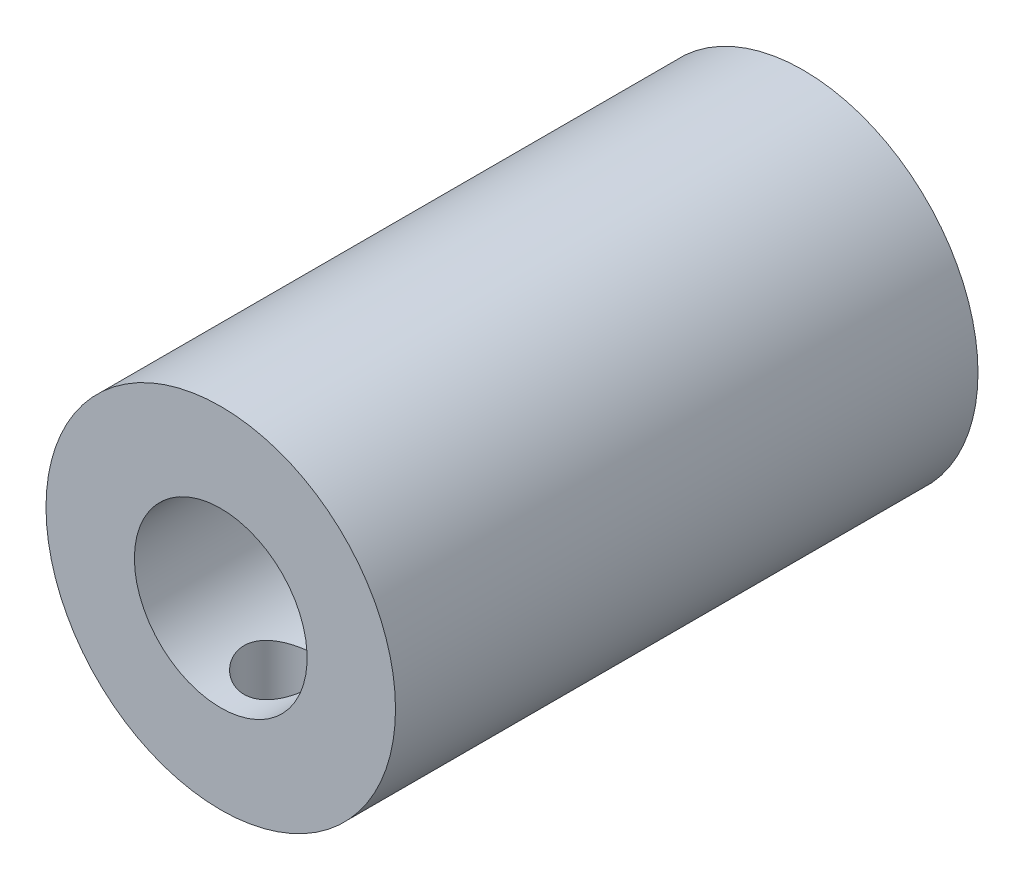
ISO-10303-21;
HEADER;
FILE_DESCRIPTION(('STEP AP214'),'2;1');
FILE_NAME('part.step','',(''),(''),'','','');
FILE_SCHEMA(('AUTOMOTIVE_DESIGN { 1 0 10303 214 1 1 1 1 }'));
ENDSEC;
DATA;
#1=APPLICATION_CONTEXT('core data for automotive mechanical design processes');
#2=APPLICATION_PROTOCOL_DEFINITION('international standard','automotive_design',2000,#1);
#3=PRODUCT_CONTEXT('',#1,'mechanical');
#4=PRODUCT('Part','Part','',(#3));
#5=PRODUCT_RELATED_PRODUCT_CATEGORY('part','',(#4));
#6=PRODUCT_DEFINITION_FORMATION('','',#4);
#7=PRODUCT_DEFINITION_CONTEXT('part definition',#1,'design');
#8=PRODUCT_DEFINITION('design','',#6,#7);
#9=PRODUCT_DEFINITION_SHAPE('','',#8);
#10=(LENGTH_UNIT() NAMED_UNIT(*) SI_UNIT(.MILLI.,.METRE.));
#11=(NAMED_UNIT(*) PLANE_ANGLE_UNIT() SI_UNIT($,.RADIAN.));
#12=(NAMED_UNIT(*) SI_UNIT($,.STERADIAN.) SOLID_ANGLE_UNIT());
#13=UNCERTAINTY_MEASURE_WITH_UNIT(LENGTH_MEASURE(1.E-05),#10,'distance_accuracy_value','');
#14=(GEOMETRIC_REPRESENTATION_CONTEXT(3) GLOBAL_UNCERTAINTY_ASSIGNED_CONTEXT((#13)) GLOBAL_UNIT_ASSIGNED_CONTEXT((#10,
#11,#12)) REPRESENTATION_CONTEXT('',''));
#15=CARTESIAN_POINT('',(0.,0.,0.));
#16=DIRECTION('',(0.,0.,1.));
#17=DIRECTION('',(1.,0.,0.));
#18=AXIS2_PLACEMENT_3D('',#15,#16,#17);
#19=CARTESIAN_POINT('',(0.,0.,0.));
#20=DIRECTION('',(0.,0.,1.));
#21=DIRECTION('',(1.,0.,0.));
#22=AXIS2_PLACEMENT_3D('',#19,#20,#21);
#23=PLANE('',#22);
#24=CARTESIAN_POINT('',(0.,0.,0.));
#25=DIRECTION('',(0.,0.,1.));
#26=DIRECTION('',(1.,0.,0.));
#27=AXIS2_PLACEMENT_3D('',#24,#25,#26);
#28=CIRCLE('',#27,7.5);
#29=CARTESIAN_POINT('',(7.5,0.,0.));
#30=VERTEX_POINT('',#29);
#31=EDGE_CURVE('E45',#30,#30,#28,.T.);
#32=ORIENTED_EDGE('',*,*,#31,.F.);
#33=EDGE_LOOP('',(#32));
#34=FACE_BOUND('',#33,.T.);
#35=CARTESIAN_POINT('',(0.,0.,0.));
#36=DIRECTION('',(0.,0.,1.));
#37=DIRECTION('',(1.,0.,0.));
#38=AXIS2_PLACEMENT_3D('',#35,#36,#37);
#39=CIRCLE('',#38,2.55);
#40=CARTESIAN_POINT('',(2.55,0.,0.));
#41=VERTEX_POINT('',#40);
#42=EDGE_CURVE('E53',#41,#41,#39,.T.);
#43=ORIENTED_EDGE('',*,*,#42,.T.);
#44=EDGE_LOOP('',(#43));
#45=FACE_BOUND('',#44,.T.);
#46=ADVANCED_FACE('F32',(#34,#45),#23,.F.);
#47=CARTESIAN_POINT('',(0.,0.,25.));
#48=DIRECTION('',(0.,0.,-1.));
#49=DIRECTION('',(-1.,0.,0.));
#50=AXIS2_PLACEMENT_3D('',#47,#48,#49);
#51=CYLINDRICAL_SURFACE('',#50,7.5);
#52=CARTESIAN_POINT('',(0.,-7.5,24.));
#53=CARTESIAN_POINT('',(0.0833653601889494,-7.49999846371307,23.9999969332525));
#54=CARTESIAN_POINT('',(0.166769490302283,-7.49859577767347,23.9930267355485));
#55=CARTESIAN_POINT('',(0.331220261533528,-7.49313548434847,23.9653522498271));
#56=CARTESIAN_POINT('',(0.412264976312033,-7.48907576790279,23.9446370507977));
#57=CARTESIAN_POINT('',(0.569595457894969,-7.4787547391743,23.8901380895688));
#58=CARTESIAN_POINT('',(0.645885701899701,-7.47249553615077,23.856366844733));
#59=CARTESIAN_POINT('',(0.791711983296338,-7.45845597052972,23.7767516287331));
#60=CARTESIAN_POINT('',(0.861248422613717,-7.4506756985356,23.7309083765892));
#61=CARTESIAN_POINT('',(0.992540215972297,-7.43433247994955,23.6277922585628));
#62=CARTESIAN_POINT('',(1.05419092673779,-7.42576118256521,23.5703874669132));
#63=CARTESIAN_POINT('',(1.16705513491204,-7.40886270678882,23.4460613754124));
#64=CARTESIAN_POINT('',(1.21826781715564,-7.40053554750636,23.3791393329973));
#65=CARTESIAN_POINT('',(1.30924763002143,-7.38498662718923,23.2369257104822));
#66=CARTESIAN_POINT('',(1.3489064082988,-7.37777561047419,23.1615635343055));
#67=CARTESIAN_POINT('',(1.41495849987046,-7.36539402087627,23.0050772714939));
#68=CARTESIAN_POINT('',(1.44135312365586,-7.36022324642943,22.9239537549805));
#69=CARTESIAN_POINT('',(1.47978794982724,-7.35259207878307,22.7593734541381));
#70=CARTESIAN_POINT('',(1.49201174693817,-7.35009705160782,22.6759611837867));
#71=CARTESIAN_POINT('',(1.50232819158918,-7.34799562590941,22.5082352679535));
#72=CARTESIAN_POINT('',(1.50042228407025,-7.34838893201761,22.4239217155198));
#73=CARTESIAN_POINT('',(1.48268185965273,-7.35198826722277,22.2581298179685));
#74=CARTESIAN_POINT('',(1.46705781036586,-7.35515179288145,22.176627891559));
#75=CARTESIAN_POINT('',(1.42265682693458,-7.36386819240002,22.0174258850055));
#76=CARTESIAN_POINT('',(1.39387926465102,-7.36942118036668,21.9397259866215));
#77=CARTESIAN_POINT('',(1.32378717551208,-7.38233427750612,21.7897271074446));
#78=CARTESIAN_POINT('',(1.28238922684817,-7.38970634720557,21.7174681806462));
#79=CARTESIAN_POINT('',(1.18829036185902,-7.40541928159593,21.5808437250408));
#80=CARTESIAN_POINT('',(1.13558814653524,-7.41376025757549,21.5164791047233));
#81=CARTESIAN_POINT('',(1.01924990184088,-7.43065531862193,21.3962558963146));
#82=CARTESIAN_POINT('',(0.955434241818668,-7.43921053816357,21.3405711482113));
#83=CARTESIAN_POINT('',(0.819277536093016,-7.45543273071613,21.2406692305482));
#84=CARTESIAN_POINT('',(0.746936381069085,-7.4630996923346,21.1964522080596));
#85=CARTESIAN_POINT('',(0.595589080318382,-7.47670035241331,21.120708736161));
#86=CARTESIAN_POINT('',(0.516572729377951,-7.48263133272408,21.0892021595332));
#87=CARTESIAN_POINT('',(0.354223464672998,-7.49207113481787,21.0399592889422));
#88=CARTESIAN_POINT('',(0.270891075108675,-7.49558025000797,21.0222213268896));
#89=CARTESIAN_POINT('',(0.103769108440726,-7.49974007800302,21.0012653193086));
#90=CARTESIAN_POINT('',(0.0200104924883649,-7.50043761978705,20.9978093706896));
#91=CARTESIAN_POINT('',(-0.14688740128907,-7.49902577895154,21.0048747884133));
#92=CARTESIAN_POINT('',(-0.230026713665689,-7.49691655412169,21.0153953690289));
#93=CARTESIAN_POINT('',(-0.39255848991981,-7.49015748012027,21.0499175603159));
#94=CARTESIAN_POINT('',(-0.471977922509853,-7.4855306460631,21.0737971027469));
#95=CARTESIAN_POINT('',(-0.6256854412495,-7.47425328091549,21.1342259739837));
#96=CARTESIAN_POINT('',(-0.699973142456309,-7.4676025982134,21.1707762520152));
#97=CARTESIAN_POINT('',(-0.842311760529325,-7.45289867299942,21.256023735977));
#98=CARTESIAN_POINT('',(-0.91027519012828,-7.44482925655578,21.3048641715584));
#99=CARTESIAN_POINT('',(-1.03712702867881,-7.42822102244824,21.4131137868109));
#100=CARTESIAN_POINT('',(-1.09601446339614,-7.41968215452582,21.4725240995998));
#101=CARTESIAN_POINT('',(-1.20396088616126,-7.40293955335447,21.6013100278367));
#102=CARTESIAN_POINT('',(-1.25285655367298,-7.39474290349956,21.670823616332));
#103=CARTESIAN_POINT('',(-1.33827813007681,-7.37976287694291,21.817217042035));
#104=CARTESIAN_POINT('',(-1.37480453388435,-7.37297944370014,21.8940965843603));
#105=CARTESIAN_POINT('',(-1.43422776237294,-7.36165110876574,22.0526523692243));
#106=CARTESIAN_POINT('',(-1.45719524968658,-7.3570946230828,22.1343012618155));
#107=CARTESIAN_POINT('',(-1.48906297744079,-7.35071155188038,22.3004001802364));
#108=CARTESIAN_POINT('',(-1.49796505233767,-7.34888461036667,22.384849839314));
#109=CARTESIAN_POINT('',(-1.5013813663012,-7.34818724447069,22.5525132968165));
#110=CARTESIAN_POINT('',(-1.49615368210635,-7.34926378783951,22.6357217233905));
#111=CARTESIAN_POINT('',(-1.47202845615009,-7.35413360226921,22.8000474748575));
#112=CARTESIAN_POINT('',(-1.45313102419395,-7.35792685150754,22.8811648165422));
#113=CARTESIAN_POINT('',(-1.40231785274843,-7.36777896328738,23.0388415668608));
#114=CARTESIAN_POINT('',(-1.37043376007602,-7.37383231528246,23.1154115407536));
#115=CARTESIAN_POINT('',(-1.29458196690241,-7.38752572461255,23.2621555811017));
#116=CARTESIAN_POINT('',(-1.25061325316233,-7.39516591498341,23.3323291105877));
#117=CARTESIAN_POINT('',(-1.15095887217962,-7.41133440784838,23.4655733582255));
#118=CARTESIAN_POINT('',(-1.09508683085277,-7.41987559364549,23.5285031479014));
#119=CARTESIAN_POINT('',(-0.973596553519712,-7.43679122807932,23.6441793082938));
#120=CARTESIAN_POINT('',(-0.907976080730004,-7.44516563794777,23.6969233354759));
#121=CARTESIAN_POINT('',(-0.768026443632371,-7.46090748581957,23.7912519659197));
#122=CARTESIAN_POINT('',(-0.693613326644755,-7.46826346828869,23.83271400492));
#123=CARTESIAN_POINT('',(-0.538749541411102,-7.481026876275,23.9024791838949));
#124=CARTESIAN_POINT('',(-0.458304391294692,-7.48643605707924,23.9307941842987));
#125=CARTESIAN_POINT('',(-0.314732233385672,-7.49364558893056,23.9679779220671));
#126=CARTESIAN_POINT('',(-0.252422496020679,-7.49601454737678,23.9799647905616));
#127=CARTESIAN_POINT('',(-0.126749287815102,-7.49919231209839,23.9959768685375));
#128=CARTESIAN_POINT('',(-0.0633858506229294,-7.50000116809732,24.0000023317647));
#129=CARTESIAN_POINT('',(0.,-7.5,24.));
#130=B_SPLINE_CURVE_WITH_KNOTS('',3,(#52,#53,#54,#55,#56,#57,#58,#59,#60,#61,#62,#63,#64,#65,
#66,#67,#68,#69,#70,#71,#72,#73,#74,#75,#76,#77,#78,#79,#80,#81,#82,#83,#84,#85,#86,#87,#88,#89,
#90,#91,#92,#93,#94,#95,#96,#97,#98,#99,#100,#101,#102,#103,#104,#105,#106,#107,#108,#109,#110,
#111,#112,#113,#114,#115,#116,#117,#118,#119,#120,#121,#122,#123,#124,#125,#126,#127,#128,#129),
.UNSPECIFIED.,.T.,.F.,(4,2,2,2,2,2,2,2,2,2,2,2,2,2,2,2,2,2,2,2,2,2,2,2,2,2,2,2,2,2,2,2,2,2,2,2,
2,2,4),(0.,0.249864195991887,0.499926976036984,0.749750602875512,0.999559353346293,
1.25239900516828,1.50525839512105,1.76041792508884,2.01555224047797,2.26734277655381,
2.51910756421838,2.76707590509417,3.01505608880594,3.26471235305389,3.51439732124506,
3.76857378737026,4.02275351309731,4.27732912281036,4.53187388547054,4.78216103514398,
5.03243411486801,5.28045680926085,5.52849808824034,5.77957599050038,6.03068082518895,
6.2856094286884,6.540527830852,6.79410571549085,7.04765052495622,7.29659583851552,
7.54553915238913,7.79387941879665,8.042240513728,8.29482114358715,8.54745981799396,
8.80274245013456,9.05779433276278,9.24778162934841,9.43776287056495),.UNSPECIFIED.);
#131=CARTESIAN_POINT('',(0.,-7.5,24.));
#132=VERTEX_POINT('',#131);
#133=EDGE_CURVE('E62',#132,#132,#130,.T.);
#134=ORIENTED_EDGE('',*,*,#133,.T.);
#135=EDGE_LOOP('',(#134));
#136=FACE_BOUND('',#135,.T.);
#137=CARTESIAN_POINT('',(0.,-7.5,4.46776140325785));
#138=CARTESIAN_POINT('',(0.083365360188948,-7.49999846371307,4.46775833651033));
#139=CARTESIAN_POINT('',(0.166769490302282,-7.49859577767347,4.46078813880638));
#140=CARTESIAN_POINT('',(0.331220261533527,-7.49313548434847,4.43311365308498));
#141=CARTESIAN_POINT('',(0.412264976312032,-7.48907576790279,4.41239845405558));
#142=CARTESIAN_POINT('',(0.569595457894968,-7.4787547391743,4.35789949282667));
#143=CARTESIAN_POINT('',(0.6458857018997,-7.47249553615077,4.32412824799082));
#144=CARTESIAN_POINT('',(0.791711983296337,-7.45845597052972,4.24451303199091));
#145=CARTESIAN_POINT('',(0.861248422613716,-7.4506756985356,4.19866977984704));
#146=CARTESIAN_POINT('',(0.992540215972296,-7.43433247994955,4.0955536618207));
#147=CARTESIAN_POINT('',(1.05419092673778,-7.42576118256521,4.03814887017105));
#148=CARTESIAN_POINT('',(1.16705513491204,-7.40886270678883,3.9138227786703));
#149=CARTESIAN_POINT('',(1.21826781715564,-7.40053554750636,3.84690073625517));
#150=CARTESIAN_POINT('',(1.30924763002143,-7.38498662718923,3.70468711374004));
#151=CARTESIAN_POINT('',(1.3489064082988,-7.37777561047419,3.62932493756331));
#152=CARTESIAN_POINT('',(1.41495849987046,-7.36539402087627,3.47283867475173));
#153=CARTESIAN_POINT('',(1.44135312365585,-7.36022324642943,3.39171515823833));
#154=CARTESIAN_POINT('',(1.47978794982724,-7.35259207878307,3.22713485739597));
#155=CARTESIAN_POINT('',(1.49201174693816,-7.35009705160782,3.14372258704451));
#156=CARTESIAN_POINT('',(1.50232819158918,-7.34799562590941,2.97599667121134));
#157=CARTESIAN_POINT('',(1.50042228407025,-7.34838893201761,2.89168311877763));
#158=CARTESIAN_POINT('',(1.48268185965273,-7.35198826722277,2.72589122122634));
#159=CARTESIAN_POINT('',(1.46705781036586,-7.35515179288145,2.64438929481688));
#160=CARTESIAN_POINT('',(1.42265682693457,-7.36386819240002,2.48518728826335));
#161=CARTESIAN_POINT('',(1.39387926465102,-7.36942118036668,2.40748738987934));
#162=CARTESIAN_POINT('',(1.32378717551208,-7.38233427750612,2.25748851070245));
#163=CARTESIAN_POINT('',(1.28238922684817,-7.38970634720557,2.18522958390409));
#164=CARTESIAN_POINT('',(1.18829036185902,-7.40541928159593,2.04860512829863));
#165=CARTESIAN_POINT('',(1.13558814653524,-7.41376025757549,1.98424050798111));
#166=CARTESIAN_POINT('',(1.01924990184087,-7.43065531862193,1.86401729957244));
#167=CARTESIAN_POINT('',(0.955434241818665,-7.43921053816357,1.80833255146915));
#168=CARTESIAN_POINT('',(0.819277536093012,-7.45543273071613,1.70843063380601));
#169=CARTESIAN_POINT('',(0.746936381069081,-7.4630996923346,1.66421361131748));
#170=CARTESIAN_POINT('',(0.595589080318378,-7.47670035241331,1.58847013941889));
#171=CARTESIAN_POINT('',(0.516572729377947,-7.48263133272408,1.55696356279104));
#172=CARTESIAN_POINT('',(0.354223464672994,-7.49207113481788,1.5077206922));
#173=CARTESIAN_POINT('',(0.270891075108672,-7.49558025000797,1.48998273014741));
#174=CARTESIAN_POINT('',(0.103769108440723,-7.49974007800302,1.46902672256643));
#175=CARTESIAN_POINT('',(0.0200104924883618,-7.50043761978705,1.46557077394745));
#176=CARTESIAN_POINT('',(-0.146887401289074,-7.49902577895154,1.47263619167112));
#177=CARTESIAN_POINT('',(-0.230026713665692,-7.49691655412169,1.48315677228674));
#178=CARTESIAN_POINT('',(-0.392558489919814,-7.49015748012027,1.51767896357378));
#179=CARTESIAN_POINT('',(-0.471977922509857,-7.4855306460631,1.5415585060047));
#180=CARTESIAN_POINT('',(-0.625685441249503,-7.47425328091549,1.60198737724156));
#181=CARTESIAN_POINT('',(-0.699973142456312,-7.4676025982134,1.6385376552731));
#182=CARTESIAN_POINT('',(-0.842311760529329,-7.45289867299942,1.72378513923482));
#183=CARTESIAN_POINT('',(-0.910275190128284,-7.44482925655578,1.77262557481627));
#184=CARTESIAN_POINT('',(-1.03712702867881,-7.42822102244824,1.88087519006877));
#185=CARTESIAN_POINT('',(-1.09601446339615,-7.41968215452582,1.94028550285765));
#186=CARTESIAN_POINT('',(-1.20396088616127,-7.40293955335448,2.06907143109454));
#187=CARTESIAN_POINT('',(-1.25285655367298,-7.39474290349956,2.13858501958986));
#188=CARTESIAN_POINT('',(-1.33827813007681,-7.37976287694291,2.28497844529287));
#189=CARTESIAN_POINT('',(-1.37480453388436,-7.37297944370014,2.36185798761818));
#190=CARTESIAN_POINT('',(-1.43422776237294,-7.36165110876574,2.52041377248217));
#191=CARTESIAN_POINT('',(-1.45719524968658,-7.3570946230828,2.60206266507333));
#192=CARTESIAN_POINT('',(-1.4890629774408,-7.35071155188038,2.76816158349421));
#193=CARTESIAN_POINT('',(-1.49796505233767,-7.34888461036667,2.85261124257187));
#194=CARTESIAN_POINT('',(-1.5013813663012,-7.34818724447069,3.02027470007433));
#195=CARTESIAN_POINT('',(-1.49615368210635,-7.34926378783951,3.10348312664836));
#196=CARTESIAN_POINT('',(-1.47202845615009,-7.35413360226921,3.26780887811539));
#197=CARTESIAN_POINT('',(-1.45313102419395,-7.35792685150754,3.34892621980006));
#198=CARTESIAN_POINT('',(-1.40231785274843,-7.36777896328738,3.50660297011867));
#199=CARTESIAN_POINT('',(-1.37043376007602,-7.37383231528246,3.58317294401147));
#200=CARTESIAN_POINT('',(-1.29458196690241,-7.38752572461255,3.72991698435951));
#201=CARTESIAN_POINT('',(-1.25061325316232,-7.39516591498341,3.80009051384556));
#202=CARTESIAN_POINT('',(-1.15095887217962,-7.41133440784838,3.93333476148332));
#203=CARTESIAN_POINT('',(-1.09508683085277,-7.41987559364549,3.99626455115924));
#204=CARTESIAN_POINT('',(-0.973596553519712,-7.43679122807932,4.11194071155161));
#205=CARTESIAN_POINT('',(-0.907976080730004,-7.44516563794777,4.16468473873376));
#206=CARTESIAN_POINT('',(-0.768026443632371,-7.46090748581957,4.25901336917752));
#207=CARTESIAN_POINT('',(-0.693613326644753,-7.46826346828869,4.30047540817789));
#208=CARTESIAN_POINT('',(-0.5387495414111,-7.481026876275,4.37024058715274));
#209=CARTESIAN_POINT('',(-0.45830439129469,-7.48643605707924,4.39855558755659));
#210=CARTESIAN_POINT('',(-0.314732233385671,-7.49364558893056,4.43573932532492));
#211=CARTESIAN_POINT('',(-0.252422496020678,-7.49601454737678,4.44772619381949));
#212=CARTESIAN_POINT('',(-0.126749287815102,-7.49919231209839,4.4637382717954));
#213=CARTESIAN_POINT('',(-0.0633858506229302,-7.50000116809732,4.4677637350225));
#214=CARTESIAN_POINT('',(0.,-7.5,4.46776140325785));
#215=B_SPLINE_CURVE_WITH_KNOTS('',3,(#137,#138,#139,#140,#141,#142,#143,#144,#145,#146,#147,
#148,#149,#150,#151,#152,#153,#154,#155,#156,#157,#158,#159,#160,#161,#162,#163,#164,#165,#166,
#167,#168,#169,#170,#171,#172,#173,#174,#175,#176,#177,#178,#179,#180,#181,#182,#183,#184,#185,
#186,#187,#188,#189,#190,#191,#192,#193,#194,#195,#196,#197,#198,#199,#200,#201,#202,#203,#204,
#205,#206,#207,#208,#209,#210,#211,#212,#213,#214),.UNSPECIFIED.,.T.,.F.,(4,2,2,2,2,2,2,2,2,2,2,
2,2,2,2,2,2,2,2,2,2,2,2,2,2,2,2,2,2,2,2,2,2,2,2,2,2,2,4),(0.,0.249864195991887,
0.499926976036985,0.749750602875513,0.999559353346294,1.25239900516828,1.50525839512105,
1.76041792508884,2.01555224047796,2.26734277655381,2.51910756421838,2.76707590509417,
3.01505608880595,3.26471235305389,3.51439732124506,3.76857378737026,4.0227535130973,
4.27732912281036,4.53187388547054,4.78216103514398,5.03243411486801,5.28045680926085,
5.52849808824034,5.77957599050038,6.03068082518895,6.28560942868839,6.540527830852,
6.79410571549085,7.04765052495622,7.29659583851552,7.54553915238913,7.79387941879665,
8.042240513728,8.29482114358714,8.54745981799396,8.80274245013456,9.05779433276278,
9.24778162934841,9.43776287056494),.UNSPECIFIED.);
#216=CARTESIAN_POINT('',(0.,-7.5,4.46776140325785));
#217=VERTEX_POINT('',#216);
#218=EDGE_CURVE('E61',#217,#217,#215,.T.);
#219=ORIENTED_EDGE('',*,*,#218,.T.);
#220=EDGE_LOOP('',(#219));
#221=FACE_BOUND('',#220,.T.);
#222=CARTESIAN_POINT('',(0.,0.,25.));
#223=DIRECTION('',(0.,0.,1.));
#224=DIRECTION('',(1.,0.,0.));
#225=AXIS2_PLACEMENT_3D('',#222,#223,#224);
#226=CIRCLE('',#225,7.5);
#227=CARTESIAN_POINT('',(7.5,0.,25.));
#228=VERTEX_POINT('',#227);
#229=EDGE_CURVE('E11',#228,#228,#226,.T.);
#230=ORIENTED_EDGE('',*,*,#229,.F.);
#231=EDGE_LOOP('',(#230));
#232=FACE_BOUND('',#231,.T.);
#233=ORIENTED_EDGE('',*,*,#31,.T.);
#234=EDGE_LOOP('',(#233));
#235=FACE_BOUND('',#234,.T.);
#236=ADVANCED_FACE('F34',(#136,#221,#232,#235),#51,.T.);
#237=CARTESIAN_POINT('',(0.,0.,25.));
#238=DIRECTION('',(0.,0.,1.));
#239=DIRECTION('',(1.,0.,0.));
#240=AXIS2_PLACEMENT_3D('',#237,#238,#239);
#241=PLANE('',#240);
#242=CARTESIAN_POINT('',(0.,0.,25.));
#243=DIRECTION('',(0.,0.,-1.));
#244=DIRECTION('',(-1.,0.,0.));
#245=AXIS2_PLACEMENT_3D('',#242,#243,#244);
#246=CIRCLE('',#245,3.70681157924785);
#247=CARTESIAN_POINT('',(-3.70681157924785,0.,25.));
#248=VERTEX_POINT('',#247);
#249=EDGE_CURVE('E84',#248,#248,#246,.T.);
#250=ORIENTED_EDGE('',*,*,#249,.T.);
#251=EDGE_LOOP('',(#250));
#252=FACE_BOUND('',#251,.T.);
#253=ORIENTED_EDGE('',*,*,#229,.T.);
#254=EDGE_LOOP('',(#253));
#255=FACE_BOUND('',#254,.T.);
#256=ADVANCED_FACE('F100',(#252,#255),#241,.T.);
#257=CARTESIAN_POINT('',(0.,0.,5.));
#258=DIRECTION('',(0.,0.,-1.));
#259=DIRECTION('',(-1.,0.,0.));
#260=AXIS2_PLACEMENT_3D('',#257,#258,#259);
#261=CYLINDRICAL_SURFACE('',#260,2.55);
#262=CARTESIAN_POINT('',(0.,-2.55,4.46776140325785));
#263=CARTESIAN_POINT('',(0.076983403014155,-2.54999387035735,4.46775445972796));
#264=CARTESIAN_POINT('',(0.154080738715477,-2.54647563661658,4.46179404277093));
#265=CARTESIAN_POINT('',(0.305988071752011,-2.53273068444616,4.43824167944535));
#266=CARTESIAN_POINT('',(0.380791309668881,-2.52248582541092,4.42061827890066));
#267=CARTESIAN_POINT('',(0.525560330170748,-2.4963314487874,4.37471690767012));
#268=CARTESIAN_POINT('',(0.59554804096355,-2.48044996308686,4.34649162213384));
#269=CARTESIAN_POINT('',(0.729584144287753,-2.44438756592114,4.28050377157213));
#270=CARTESIAN_POINT('',(0.793634394817819,-2.42420800600732,4.24274420395956));
#271=CARTESIAN_POINT('',(0.91940238054969,-2.37949140166581,4.15560942261704));
#272=CARTESIAN_POINT('',(0.980587429354538,-2.35474133963835,4.10557669971173));
#273=CARTESIAN_POINT('',(1.09421823149642,-2.30414066088766,3.99678285420052));
#274=CARTESIAN_POINT('',(1.14665287241768,-2.27828869631908,3.93801080960017));
#275=CARTESIAN_POINT('',(1.24749478317438,-2.2248319436702,3.80531236519918));
#276=CARTESIAN_POINT('',(1.29471676144251,-2.19737499092928,3.73041775686261));
#277=CARTESIAN_POINT('',(1.37571426185691,-2.14759890003646,3.572145004127));
#278=CARTESIAN_POINT('',(1.40951108427838,-2.12527164705871,3.48878056399378));
#279=CARTESIAN_POINT('',(1.45580562683428,-2.09373450246308,3.33578900906078));
#280=CARTESIAN_POINT('',(1.47143194210528,-2.08268004780358,3.26749004051029));
#281=CARTESIAN_POINT('',(1.49299295521335,-2.06728200150309,3.12866825836867));
#282=CARTESIAN_POINT('',(1.49893898779593,-2.06293056155309,3.05814814435408));
#283=CARTESIAN_POINT('',(1.50080215754229,-2.06157584084915,2.91678376125636));
#284=CARTESIAN_POINT('',(1.49670226641141,-2.06458503669051,2.84593914523295));
#285=CARTESIAN_POINT('',(1.47869205783705,-2.07751933261925,2.7061405426806));
#286=CARTESIAN_POINT('',(1.46477461507524,-2.08744945566909,2.63718796712814));
#287=CARTESIAN_POINT('',(1.42801413511204,-2.11276166033829,2.50349301628942));
#288=CARTESIAN_POINT('',(1.40525174560248,-2.12809436699916,2.43871859700893));
#289=CARTESIAN_POINT('',(1.35161631328246,-2.16255575970916,2.31372411488372));
#290=CARTESIAN_POINT('',(1.32074024232772,-2.18168586234846,2.25350576325938));
#291=CARTESIAN_POINT('',(1.2457366193682,-2.22549474173058,2.12852888730485));
#292=CARTESIAN_POINT('',(1.20025168396159,-2.2505649557596,2.06472148129116));
#293=CARTESIAN_POINT('',(1.10003158527548,-2.30121457499646,1.94500359629538));
#294=CARTESIAN_POINT('',(1.04528795389733,-2.32679442725825,1.88910043333432));
#295=CARTESIAN_POINT('',(0.919720494179615,-2.37945754425591,1.77952106414276));
#296=CARTESIAN_POINT('',(0.847734507046055,-2.40631213423717,1.72705241447783));
#297=CARTESIAN_POINT('',(0.694325156730875,-2.45496876805585,1.63513558860558));
#298=CARTESIAN_POINT('',(0.612907321660721,-2.47677374927234,1.59567983704454));
#299=CARTESIAN_POINT('',(0.448394302778245,-2.51157991748809,1.53383593525742));
#300=CARTESIAN_POINT('',(0.365765023144959,-2.52506743129572,1.51049267444696));
#301=CARTESIAN_POINT('',(0.196855892123344,-2.54380401779276,1.47825939935235));
#302=CARTESIAN_POINT('',(0.11058019132631,-2.54906221135954,1.46935338331276));
#303=CARTESIAN_POINT('',(-0.0510240412017243,-2.55060183239036,1.46674027088899));
#304=CARTESIAN_POINT('',(-0.126320077288287,-2.54795976191143,1.47121055928433));
#305=CARTESIAN_POINT('',(-0.27489334214577,-2.53623415575386,1.4912619966949));
#306=CARTESIAN_POINT('',(-0.348170577099099,-2.5271506398039,1.50684311168022));
#307=CARTESIAN_POINT('',(-0.489432912575395,-2.50359699830453,1.5479815197194));
#308=CARTESIAN_POINT('',(-0.557489977087737,-2.48922774267965,1.5733524083249));
#309=CARTESIAN_POINT('',(-0.688392431065791,-2.45625272213017,1.63310883290412));
#310=CARTESIAN_POINT('',(-0.751236700571294,-2.43764605000351,1.66749629950482));
#311=CARTESIAN_POINT('',(-0.877001740602613,-2.39545674361377,1.74832517772862));
#312=CARTESIAN_POINT('',(-0.939247573108747,-2.37155759069325,1.79564945716261));
#313=CARTESIAN_POINT('',(-1.0553938278062,-2.32220483457066,1.89902402355375));
#314=CARTESIAN_POINT('',(-1.10928437329511,-2.29674944054839,1.95508448292066));
#315=CARTESIAN_POINT('',(-1.21397151779752,-2.2433526548933,2.08239365862665));
#316=CARTESIAN_POINT('',(-1.26357641029115,-2.21548964060279,2.15466203252089));
#317=CARTESIAN_POINT('',(-1.34990824467973,-2.16397356287028,2.30787129442216));
#318=CARTESIAN_POINT('',(-1.38665045619509,-2.14031552413852,2.38880174932821));
#319=CARTESIAN_POINT('',(-1.43923724484973,-2.10520147710431,2.53938206073061));
#320=CARTESIAN_POINT('',(-1.45788116804141,-2.09221373738061,2.60769404033235));
#321=CARTESIAN_POINT('',(-1.48538105390895,-2.07278415850344,2.74713304029441));
#322=CARTESIAN_POINT('',(-1.49424961350519,-2.06633389576378,2.81825631512068));
#323=CARTESIAN_POINT('',(-1.50170641739174,-2.06092275748992,2.96155041674317));
#324=CARTESIAN_POINT('',(-1.50026401354796,-2.06198420955656,3.03372372965709));
#325=CARTESIAN_POINT('',(-1.48711896342983,-2.07148200448262,3.17664986438808));
#326=CARTESIAN_POINT('',(-1.47541021259241,-2.07992273519122,3.24740181542808));
#327=CARTESIAN_POINT('',(-1.44297451598014,-2.10254444190978,3.38312897774631));
#328=CARTESIAN_POINT('',(-1.42257432646869,-2.1165162439968,3.44821942601458));
#329=CARTESIAN_POINT('',(-1.37362978936694,-2.14860304470618,3.57415320763676));
#330=CARTESIAN_POINT('',(-1.34508237845749,-2.16671960122865,3.63499493275934));
#331=CARTESIAN_POINT('',(-1.27556399815447,-2.20846555885449,3.76077423660329));
#332=CARTESIAN_POINT('',(-1.23335371373446,-2.23251421426608,3.82488695059918));
#333=CARTESIAN_POINT('',(-1.13990637146667,-2.28164535065153,3.9457479995343));
#334=CARTESIAN_POINT('',(-1.0886620979585,-2.3067286456561,4.00249038422186));
#335=CARTESIAN_POINT('',(-0.969700782287511,-2.35944954757615,4.11552326847878));
#336=CARTESIAN_POINT('',(-0.900669724332886,-2.38692110363536,4.17052293763265));
#337=CARTESIAN_POINT('',(-0.752877740499427,-2.43757688031252,4.26815403557824));
#338=CARTESIAN_POINT('',(-0.674114232915798,-2.46075995924592,4.3107821725162));
#339=CARTESIAN_POINT('',(-0.512190123597191,-2.49935075748825,4.38022598023229));
#340=CARTESIAN_POINT('',(-0.42936281680028,-2.51504921896699,4.4076412282466));
#341=CARTESIAN_POINT('',(-0.301925970507379,-2.53242813061777,4.43771116531488));
#342=CARTESIAN_POINT('',(-0.258964221833945,-2.53719107765704,4.44588932747072));
#343=CARTESIAN_POINT('',(-0.172316904488788,-2.54454057656616,4.4584710632886));
#344=CARTESIAN_POINT('',(-0.128631928880242,-2.54712882955859,4.46287758730987));
#345=CARTESIAN_POINT('',(-0.0565871628299433,-2.54952984390426,4.46696189306218));
#346=CARTESIAN_POINT('',(-0.0283012804501679,-2.55000225343034,4.4677639558962));
#347=CARTESIAN_POINT('',(0.,-2.55,4.46776140325785));
#348=B_SPLINE_CURVE_WITH_KNOTS('',3,(#262,#263,#264,#265,#266,#267,#268,#269,#270,#271,#272,
#273,#274,#275,#276,#277,#278,#279,#280,#281,#282,#283,#284,#285,#286,#287,#288,#289,#290,#291,
#292,#293,#294,#295,#296,#297,#298,#299,#300,#301,#302,#303,#304,#305,#306,#307,#308,#309,#310,
#311,#312,#313,#314,#315,#316,#317,#318,#319,#320,#321,#322,#323,#324,#325,#326,#327,#328,#329,
#330,#331,#332,#333,#334,#335,#336,#337,#338,#339,#340,#341,#342,#343,#344,#345,#346,#347),
.UNSPECIFIED.,.T.,.F.,(4,2,2,2,2,2,2,2,2,2,2,2,2,2,2,2,2,2,2,2,2,2,2,2,2,2,2,2,2,2,2,2,2,2,2,2,
2,2,2,2,2,2,4),(0.,0.230847911194792,0.462320952638293,0.692658608526362,0.922923940217465,
1.17041022990823,1.41820845712606,1.69494294984758,1.97123660653236,2.18311896538283,
2.39475305003309,2.6067461121022,2.8188931916183,3.02914967605461,3.23948474300204,
3.48534662632937,3.73143460569539,4.00911975436257,4.28664296435034,4.54583751546863,
4.80474458717324,5.0300486477856,5.25535201834648,5.47656177188382,5.69781892952157,
5.94214074966275,6.18674921368707,6.46138224922345,6.73568814634574,6.95076024915889,
7.16555487635177,7.38098822038326,7.5965497520734,7.80463729569847,8.01280318263025,
8.25320656340152,8.4938028372528,8.76974228162622,9.04575508160466,9.30993429620334,
9.44172931322151,9.5734211392821,9.65828737304495),.UNSPECIFIED.);
#349=CARTESIAN_POINT('',(0.,-2.55,4.46776140325785));
#350=VERTEX_POINT('',#349);
#351=EDGE_CURVE('E55',#350,#350,#348,.T.);
#352=ORIENTED_EDGE('',*,*,#351,.F.);
#353=EDGE_LOOP('',(#352));
#354=FACE_BOUND('',#353,.T.);
#355=CARTESIAN_POINT('',(0.,0.,5.));
#356=DIRECTION('',(0.,0.,1.));
#357=DIRECTION('',(1.,0.,0.));
#358=AXIS2_PLACEMENT_3D('',#355,#356,#357);
#359=CIRCLE('',#358,2.55);
#360=CARTESIAN_POINT('',(2.55,0.,5.));
#361=VERTEX_POINT('',#360);
#362=EDGE_CURVE('E50',#361,#361,#359,.T.);
#363=ORIENTED_EDGE('',*,*,#362,.T.);
#364=EDGE_LOOP('',(#363));
#365=FACE_BOUND('',#364,.T.);
#366=ORIENTED_EDGE('',*,*,#42,.F.);
#367=EDGE_LOOP('',(#366));
#368=FACE_BOUND('',#367,.T.);
#369=ADVANCED_FACE('F63',(#354,#365,#368),#261,.F.);
#370=CARTESIAN_POINT('',(0.,0.,5.));
#371=DIRECTION('',(0.,0.,1.));
#372=DIRECTION('',(1.,0.,0.));
#373=AXIS2_PLACEMENT_3D('',#370,#371,#372);
#374=PLANE('',#373);
#375=ORIENTED_EDGE('',*,*,#362,.F.);
#376=EDGE_LOOP('',(#375));
#377=FACE_BOUND('',#376,.T.);
#378=ADVANCED_FACE('F99',(#377),#374,.F.);
#379=CARTESIAN_POINT('',(0.,0.,7.));
#380=DIRECTION('',(0.,0.,-1.));
#381=DIRECTION('',(-1.,0.,0.));
#382=AXIS2_PLACEMENT_3D('',#379,#380,#381);
#383=PLANE('',#382);
#384=CARTESIAN_POINT('',(0.,0.,7.));
#385=DIRECTION('',(0.,0.,-1.));
#386=DIRECTION('',(-1.,0.,0.));
#387=AXIS2_PLACEMENT_3D('',#384,#385,#386);
#388=CIRCLE('',#387,3.70681157924785);
#389=CARTESIAN_POINT('',(-3.70681157924785,0.,7.));
#390=VERTEX_POINT('',#389);
#391=EDGE_CURVE('E89',#390,#390,#388,.T.);
#392=ORIENTED_EDGE('',*,*,#391,.F.);
#393=EDGE_LOOP('',(#392));
#394=FACE_BOUND('',#393,.T.);
#395=ADVANCED_FACE('F73',(#394),#383,.F.);
#396=CARTESIAN_POINT('',(0.,0.,25.));
#397=DIRECTION('',(0.,0.,-1.));
#398=DIRECTION('',(-1.,0.,0.));
#399=AXIS2_PLACEMENT_3D('',#396,#397,#398);
#400=CYLINDRICAL_SURFACE('',#399,3.70681157924785);
#401=CARTESIAN_POINT('',(0.,-3.70681157924785,24.));
#402=CARTESIAN_POINT('',(-0.0805449895392577,-3.70680578968659,23.9999922095087));
#403=CARTESIAN_POINT('',(-0.161226276786113,-3.70415565319579,23.9934738429514));
#404=CARTESIAN_POINT('',(-0.320311192811903,-3.69381232384037,23.9676276096131));
#405=CARTESIAN_POINT('',(-0.398708103233407,-3.68610557016703,23.9482652964644));
#406=CARTESIAN_POINT('',(-0.550665561831031,-3.66647887726392,23.8975543988176));
#407=CARTESIAN_POINT('',(-0.624241166573742,-3.65457287642932,23.8662454405382));
#408=CARTESIAN_POINT('',(-0.765027624089478,-3.62771663706137,23.7926889745561));
#409=CARTESIAN_POINT('',(-0.8322405977619,-3.61276741821677,23.7504451295136));
#410=CARTESIAN_POINT('',(-0.961717893470577,-3.5805301267,23.6540766167909));
#411=CARTESIAN_POINT('',(-1.02363699781812,-3.56316833678814,23.5995129718537));
#412=CARTESIAN_POINT('',(-1.13773901243559,-3.52839440251719,23.4809806586408));
#413=CARTESIAN_POINT('',(-1.18991706112564,-3.51098223739549,23.4170073224869));
#414=CARTESIAN_POINT('',(-1.28541087388094,-3.47719102447095,23.2779161381226));
#415=CARTESIAN_POINT('',(-1.32821147165088,-3.46089578377806,23.2024221329091));
#416=CARTESIAN_POINT('',(-1.40035271410626,-3.43234335414779,23.0445491950505));
#417=CARTESIAN_POINT('',(-1.42969990148943,-3.42008420318795,22.9621736321557));
#418=CARTESIAN_POINT('',(-1.47269690872961,-3.40178516876227,22.7968449578632));
#419=CARTESIAN_POINT('',(-1.48700865259039,-3.39548437795695,22.7140939423762));
#420=CARTESIAN_POINT('',(-1.50159553673326,-3.3890608042138,22.5471435119498));
#421=CARTESIAN_POINT('',(-1.50187780458115,-3.3889348841815,22.4629448542249));
#422=CARTESIAN_POINT('',(-1.48889849901838,-3.39465319327186,22.3019129018479));
#423=CARTESIAN_POINT('',(-1.47660417916349,-3.40007106297047,22.2249835363623));
#424=CARTESIAN_POINT('',(-1.44043613892863,-3.41554953487184,22.0743911832676));
#425=CARTESIAN_POINT('',(-1.41656034509095,-3.42561096840675,22.0007287831292));
#426=CARTESIAN_POINT('',(-1.35744916542457,-3.44946573863532,21.8569604509364));
#427=CARTESIAN_POINT('',(-1.32198924874552,-3.46333189233001,21.7869594580666));
#428=CARTESIAN_POINT('',(-1.24087432436963,-3.49321456688113,21.6536399169087));
#429=CARTESIAN_POINT('',(-1.19521543226507,-3.50923190611428,21.590323928255));
#430=CARTESIAN_POINT('',(-1.09074536816298,-3.54315833950932,21.4668891762022));
#431=CARTESIAN_POINT('',(-1.03117846950751,-3.56111673851862,21.4074218378422));
#432=CARTESIAN_POINT('',(-0.902729684859619,-3.59582447860156,21.2991093372431));
#433=CARTESIAN_POINT('',(-0.833845861014301,-3.6125735670328,21.2502663903274));
#434=CARTESIAN_POINT('',(-0.686834562622944,-3.64341302281924,21.1637069484985));
#435=CARTESIAN_POINT('',(-0.60854559728633,-3.65744135428872,21.1262410076651));
#436=CARTESIAN_POINT('',(-0.446064241705977,-3.68078775375343,21.0652365876868));
#437=CARTESIAN_POINT('',(-0.361874948668489,-3.69010827220072,21.0416908618752));
#438=CARTESIAN_POINT('',(-0.195438593529207,-3.70253918943593,21.0105253733049));
#439=CARTESIAN_POINT('',(-0.113380772623335,-3.70599031548851,21.0020305103696));
#440=CARTESIAN_POINT('',(0.0510528498177923,-3.7073708364878,20.9986170207841));
#441=CARTESIAN_POINT('',(0.133428560674926,-3.70530170438412,21.0036947726053));
#442=CARTESIAN_POINT('',(0.292156935086555,-3.69609671013544,21.0266434861719));
#443=CARTESIAN_POINT('',(0.368612013854133,-3.6891994252822,21.0439123669056));
#444=CARTESIAN_POINT('',(0.51746543616014,-3.67128120375503,21.0899287482326));
#445=CARTESIAN_POINT('',(0.589863259343322,-3.66025973952796,21.1186777173573));
#446=CARTESIAN_POINT('',(0.73105393576072,-3.63473793429728,21.1877774916241));
#447=CARTESIAN_POINT('',(0.799667493409095,-3.62014104415066,21.2284578523036));
#448=CARTESIAN_POINT('',(0.929336847756547,-3.58904423092588,21.3199010661966));
#449=CARTESIAN_POINT('',(0.990389560941075,-3.57254353669006,21.3706680111511));
#450=CARTESIAN_POINT('',(1.10753214056778,-3.53805060283857,21.4848616854601));
#451=CARTESIAN_POINT('',(1.16300835246913,-3.52003289258231,21.548911859138));
#452=CARTESIAN_POINT('',(1.26258145537568,-3.48555933257514,21.6857229989511));
#453=CARTESIAN_POINT('',(1.30667628477975,-3.46910376612868,21.7584855397379));
#454=CARTESIAN_POINT('',(1.38256570374689,-3.43957094294302,21.9118610167712));
#455=CARTESIAN_POINT('',(1.41422112263517,-3.42653242517604,21.9925508108705));
#456=CARTESIAN_POINT('',(1.4632433833768,-3.40589074173397,22.1588043662076));
#457=CARTESIAN_POINT('',(1.48062110887732,-3.39828343651703,22.2443643616715));
#458=CARTESIAN_POINT('',(1.49954325139714,-3.38997330877634,22.4111639310436));
#459=CARTESIAN_POINT('',(1.50215597155038,-3.38880478581844,22.492259812005));
#460=CARTESIAN_POINT('',(1.49429222121341,-3.39227968233508,22.6536793148774));
#461=CARTESIAN_POINT('',(1.48381750253696,-3.39692232395872,22.7340030386953));
#462=CARTESIAN_POINT('',(1.45095577658982,-3.41108145986098,22.888183720862));
#463=CARTESIAN_POINT('',(1.42908016559048,-3.42038810648504,22.962170727665));
#464=CARTESIAN_POINT('',(1.37452191762616,-3.44267416150967,23.1054506289487));
#465=CARTESIAN_POINT('',(1.34183628101476,-3.45565458919399,23.1747422140712));
#466=CARTESIAN_POINT('',(1.26439391169897,-3.48476163469529,23.3110518005891));
#467=CARTESIAN_POINT('',(1.21904626159939,-3.5010272135922,23.3777039043962));
#468=CARTESIAN_POINT('',(1.11842077553384,-3.53445828386021,23.502787481593));
#469=CARTESIAN_POINT('',(1.06313981950018,-3.55162405678059,23.5612163617423));
#470=CARTESIAN_POINT('',(0.939810428168869,-3.58630386847464,23.6722157225755));
#471=CARTESIAN_POINT('',(0.871154663291723,-3.60376416034503,23.724131238043));
#472=CARTESIAN_POINT('',(0.7254474923245,-3.63589535413994,23.8157233941223));
#473=CARTESIAN_POINT('',(0.648392231513184,-3.65056496680818,23.8553943831701));
#474=CARTESIAN_POINT('',(0.489431287552738,-3.6752229109503,23.9204586282281));
#475=CARTESIAN_POINT('',(0.407638713184784,-3.68529120684425,23.9460974357078));
#476=CARTESIAN_POINT('',(0.240565453582946,-3.69994000080718,23.9830375197815));
#477=CARTESIAN_POINT('',(0.155296687883546,-3.70453784855996,23.9943841312415));
#478=CARTESIAN_POINT('',(0.0465426545988909,-3.70659407621129,23.9994607555553));
#479=CARTESIAN_POINT('',(0.0232770189236317,-3.70681325239633,24.0000022514053));
#480=CARTESIAN_POINT('',(0.,-3.70681157924785,24.));
#481=B_SPLINE_CURVE_WITH_KNOTS('',3,(#401,#402,#403,#404,#405,#406,#407,#408,#409,#410,#411,
#412,#413,#414,#415,#416,#417,#418,#419,#420,#421,#422,#423,#424,#425,#426,#427,#428,#429,#430,
#431,#432,#433,#434,#435,#436,#437,#438,#439,#440,#441,#442,#443,#444,#445,#446,#447,#448,#449,
#450,#451,#452,#453,#454,#455,#456,#457,#458,#459,#460,#461,#462,#463,#464,#465,#466,#467,#468,
#469,#470,#471,#472,#473,#474,#475,#476,#477,#478,#479,#480),.UNSPECIFIED.,.T.,.F.,(4,2,2,2,2,2,
2,2,2,2,2,2,2,2,2,2,2,2,2,2,2,2,2,2,2,2,2,2,2,2,2,2,2,2,2,2,2,2,2,4),(0.,0.241571634089146,
0.483793776267559,0.725219371394248,0.966564204985853,1.21846930898979,1.47049980000636,
1.7340700154008,1.99751191430145,2.24879607518973,2.49995257181556,2.73314557722842,
2.96638034713456,3.20443448306033,3.44257943994971,3.69960431082755,3.95668272346046,
4.21906912297764,4.48131880729821,4.72774724046547,4.9741099266424,5.20908700549563,
5.44409415222037,5.6863273630888,5.92865904006689,6.18735711359827,6.4461020143541,
6.70766448638577,6.96902738824034,7.21121093959712,7.45336207704661,7.6854829604674,
7.91766830863721,8.1633413993077,8.40909179161988,8.67131042621009,8.93364990964833,
9.19123857414637,9.44800809237973,9.51782084585169),.UNSPECIFIED.);
#482=CARTESIAN_POINT('',(0.,-3.70681157924785,24.));
#483=VERTEX_POINT('',#482);
#484=EDGE_CURVE('E37',#483,#483,#481,.T.);
#485=ORIENTED_EDGE('',*,*,#484,.T.);
#486=EDGE_LOOP('',(#485));
#487=FACE_BOUND('',#486,.T.);
#488=ORIENTED_EDGE('',*,*,#249,.F.);
#489=EDGE_LOOP('',(#488));
#490=FACE_BOUND('',#489,.T.);
#491=ORIENTED_EDGE('',*,*,#391,.T.);
#492=EDGE_LOOP('',(#491));
#493=FACE_BOUND('',#492,.T.);
#494=ADVANCED_FACE('F71',(#487,#490,#493),#400,.F.);
#495=CARTESIAN_POINT('',(0.,-18.,2.96776140325785));
#496=DIRECTION('',(0.,1.,0.));
#497=DIRECTION('',(0.,0.,1.));
#498=AXIS2_PLACEMENT_3D('',#495,#496,#497);
#499=CYLINDRICAL_SURFACE('',#498,1.5);
#500=ORIENTED_EDGE('',*,*,#351,.T.);
#501=EDGE_LOOP('',(#500));
#502=FACE_BOUND('',#501,.T.);
#503=ORIENTED_EDGE('',*,*,#218,.F.);
#504=EDGE_LOOP('',(#503));
#505=FACE_BOUND('',#504,.T.);
#506=ADVANCED_FACE('F67',(#502,#505),#499,.F.);
#507=CARTESIAN_POINT('',(0.,-18.,22.5));
#508=DIRECTION('',(0.,1.,0.));
#509=DIRECTION('',(0.,0.,1.));
#510=AXIS2_PLACEMENT_3D('',#507,#508,#509);
#511=CYLINDRICAL_SURFACE('',#510,1.5);
#512=ORIENTED_EDGE('',*,*,#484,.F.);
#513=EDGE_LOOP('',(#512));
#514=FACE_BOUND('',#513,.T.);
#515=ORIENTED_EDGE('',*,*,#133,.F.);
#516=EDGE_LOOP('',(#515));
#517=FACE_BOUND('',#516,.T.);
#518=ADVANCED_FACE('F70',(#514,#517),#511,.F.);
#519=CLOSED_SHELL('',(#46,#236,#256,#369,#378,#395,#494,#506,#518));
#520=MANIFOLD_SOLID_BREP('B2',#519);
#521=ADVANCED_BREP_SHAPE_REPRESENTATION('',(#18,#520),#14);
#522=SHAPE_DEFINITION_REPRESENTATION(#9,#521);
ENDSEC;
END-ISO-10303-21;
